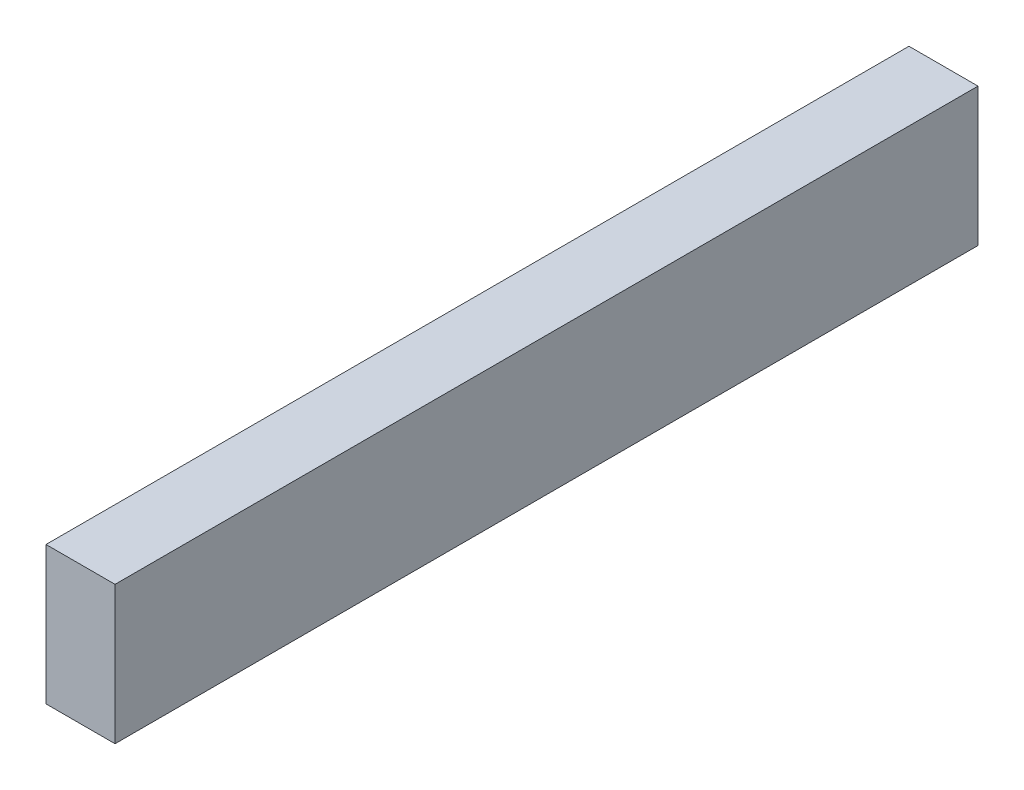
ISO-10303-21;
HEADER;
FILE_DESCRIPTION(('STEP AP214'),'2;1');
FILE_NAME('part.step','',(''),(''),'','','');
FILE_SCHEMA(('AUTOMOTIVE_DESIGN { 1 0 10303 214 1 1 1 1 }'));
ENDSEC;
DATA;
#1=APPLICATION_CONTEXT('core data for automotive mechanical design processes');
#2=APPLICATION_PROTOCOL_DEFINITION('international standard','automotive_design',2000,#1);
#3=PRODUCT_CONTEXT('',#1,'mechanical');
#4=PRODUCT('Part','Part','',(#3));
#5=PRODUCT_RELATED_PRODUCT_CATEGORY('part','',(#4));
#6=PRODUCT_DEFINITION_FORMATION('','',#4);
#7=PRODUCT_DEFINITION_CONTEXT('part definition',#1,'design');
#8=PRODUCT_DEFINITION('design','',#6,#7);
#9=PRODUCT_DEFINITION_SHAPE('','',#8);
#10=(LENGTH_UNIT() NAMED_UNIT(*) SI_UNIT(.MILLI.,.METRE.));
#11=(NAMED_UNIT(*) PLANE_ANGLE_UNIT() SI_UNIT($,.RADIAN.));
#12=(NAMED_UNIT(*) SI_UNIT($,.STERADIAN.) SOLID_ANGLE_UNIT());
#13=UNCERTAINTY_MEASURE_WITH_UNIT(LENGTH_MEASURE(1.E-05),#10,'distance_accuracy_value','');
#14=(GEOMETRIC_REPRESENTATION_CONTEXT(3) GLOBAL_UNCERTAINTY_ASSIGNED_CONTEXT((#13)) GLOBAL_UNIT_ASSIGNED_CONTEXT((#10,
#11,#12)) REPRESENTATION_CONTEXT('',''));
#15=CARTESIAN_POINT('',(0.,0.,0.));
#16=DIRECTION('',(0.,0.,1.));
#17=DIRECTION('',(1.,0.,0.));
#18=AXIS2_PLACEMENT_3D('',#15,#16,#17);
#19=CARTESIAN_POINT('',(152.,-32.3,692.64406037513));
#20=DIRECTION('',(0.,0.,-1.));
#21=DIRECTION('',(-1.,0.,0.));
#22=AXIS2_PLACEMENT_3D('',#19,#20,#21);
#23=PLANE('',#22);
#24=DIRECTION('',(0.,-1.,0.));
#25=VECTOR('',#24,1.);
#26=CARTESIAN_POINT('',(0.,-32.3,692.64406037513));
#27=LINE('',#26,#25);
#28=CARTESIAN_POINT('',(0.,271.7,692.64406037513));
#29=VERTEX_POINT('',#28);
#30=CARTESIAN_POINT('',(0.,-32.3,692.64406037513));
#31=VERTEX_POINT('',#30);
#32=EDGE_CURVE('E105',#29,#31,#27,.T.);
#33=ORIENTED_EDGE('',*,*,#32,.T.);
#34=DIRECTION('',(-1.,0.,0.));
#35=VECTOR('',#34,1.);
#36=CARTESIAN_POINT('',(152.,-32.3,692.64406037513));
#37=LINE('',#36,#35);
#38=CARTESIAN_POINT('',(152.,-32.3,692.64406037513));
#39=VERTEX_POINT('',#38);
#40=EDGE_CURVE('E12',#39,#31,#37,.T.);
#41=ORIENTED_EDGE('',*,*,#40,.F.);
#42=DIRECTION('',(0.,-1.,0.));
#43=VECTOR('',#42,1.);
#44=CARTESIAN_POINT('',(152.,-32.3,692.64406037513));
#45=LINE('',#44,#43);
#46=CARTESIAN_POINT('',(152.,271.7,692.64406037513));
#47=VERTEX_POINT('',#46);
#48=EDGE_CURVE('E93',#47,#39,#45,.T.);
#49=ORIENTED_EDGE('',*,*,#48,.F.);
#50=DIRECTION('',(-1.,0.,0.));
#51=VECTOR('',#50,1.);
#52=CARTESIAN_POINT('',(152.,271.7,692.64406037513));
#53=LINE('',#52,#51);
#54=EDGE_CURVE('E101',#47,#29,#53,.T.);
#55=ORIENTED_EDGE('',*,*,#54,.T.);
#56=EDGE_LOOP('',(#33,#41,#49,#55));
#57=FACE_BOUND('',#56,.T.);
#58=ADVANCED_FACE('F42',(#57),#23,.F.);
#59=CARTESIAN_POINT('',(152.,-32.3,692.64406037513));
#60=DIRECTION('',(0.,1.,0.));
#61=DIRECTION('',(0.,0.,1.));
#62=AXIS2_PLACEMENT_3D('',#59,#60,#61);
#63=PLANE('',#62);
#64=DIRECTION('',(0.,0.,-1.));
#65=VECTOR('',#64,1.);
#66=CARTESIAN_POINT('',(0.,-32.3,692.64406037513));
#67=LINE('',#66,#65);
#68=CARTESIAN_POINT('',(0.,-32.3,-1207.35593962487));
#69=VERTEX_POINT('',#68);
#70=EDGE_CURVE('E97',#31,#69,#67,.T.);
#71=ORIENTED_EDGE('',*,*,#70,.T.);
#72=DIRECTION('',(-1.,0.,0.));
#73=VECTOR('',#72,1.);
#74=CARTESIAN_POINT('',(152.,-32.3,-1207.35593962487));
#75=LINE('',#74,#73);
#76=CARTESIAN_POINT('',(152.,-32.3,-1207.35593962487));
#77=VERTEX_POINT('',#76);
#78=EDGE_CURVE('E50',#77,#69,#75,.T.);
#79=ORIENTED_EDGE('',*,*,#78,.F.);
#80=DIRECTION('',(0.,0.,-1.));
#81=VECTOR('',#80,1.);
#82=CARTESIAN_POINT('',(152.,-32.3,692.64406037513));
#83=LINE('',#82,#81);
#84=EDGE_CURVE('E88',#39,#77,#83,.T.);
#85=ORIENTED_EDGE('',*,*,#84,.F.);
#86=ORIENTED_EDGE('',*,*,#40,.T.);
#87=EDGE_LOOP('',(#71,#79,#85,#86));
#88=FACE_BOUND('',#87,.T.);
#89=ADVANCED_FACE('F96',(#88),#63,.F.);
#90=CARTESIAN_POINT('',(152.,-32.3,-1207.35593962487));
#91=DIRECTION('',(0.,0.,1.));
#92=DIRECTION('',(1.,0.,0.));
#93=AXIS2_PLACEMENT_3D('',#90,#91,#92);
#94=PLANE('',#93);
#95=DIRECTION('',(0.,1.,0.));
#96=VECTOR('',#95,1.);
#97=CARTESIAN_POINT('',(0.,-32.3,-1207.35593962487));
#98=LINE('',#97,#96);
#99=CARTESIAN_POINT('',(0.,271.7,-1207.35593962487));
#100=VERTEX_POINT('',#99);
#101=EDGE_CURVE('E75',#69,#100,#98,.T.);
#102=ORIENTED_EDGE('',*,*,#101,.T.);
#103=DIRECTION('',(-1.,0.,0.));
#104=VECTOR('',#103,1.);
#105=CARTESIAN_POINT('',(152.,271.7,-1207.35593962487));
#106=LINE('',#105,#104);
#107=CARTESIAN_POINT('',(152.,271.7,-1207.35593962487));
#108=VERTEX_POINT('',#107);
#109=EDGE_CURVE('E98',#108,#100,#106,.T.);
#110=ORIENTED_EDGE('',*,*,#109,.F.);
#111=DIRECTION('',(0.,1.,0.));
#112=VECTOR('',#111,1.);
#113=CARTESIAN_POINT('',(152.,-32.3,-1207.35593962487));
#114=LINE('',#113,#112);
#115=EDGE_CURVE('E91',#77,#108,#114,.T.);
#116=ORIENTED_EDGE('',*,*,#115,.F.);
#117=ORIENTED_EDGE('',*,*,#78,.T.);
#118=EDGE_LOOP('',(#102,#110,#116,#117));
#119=FACE_BOUND('',#118,.T.);
#120=ADVANCED_FACE('F99',(#119),#94,.F.);
#121=CARTESIAN_POINT('',(152.,271.7,692.64406037513));
#122=DIRECTION('',(0.,-1.,0.));
#123=DIRECTION('',(0.,0.,-1.));
#124=AXIS2_PLACEMENT_3D('',#121,#122,#123);
#125=PLANE('',#124);
#126=DIRECTION('',(0.,0.,1.));
#127=VECTOR('',#126,1.);
#128=CARTESIAN_POINT('',(0.,271.7,692.64406037513));
#129=LINE('',#128,#127);
#130=EDGE_CURVE('E81',#100,#29,#129,.T.);
#131=ORIENTED_EDGE('',*,*,#130,.T.);
#132=ORIENTED_EDGE('',*,*,#54,.F.);
#133=DIRECTION('',(0.,0.,1.));
#134=VECTOR('',#133,1.);
#135=CARTESIAN_POINT('',(152.,271.7,692.64406037513));
#136=LINE('',#135,#134);
#137=EDGE_CURVE('E58',#108,#47,#136,.T.);
#138=ORIENTED_EDGE('',*,*,#137,.F.);
#139=ORIENTED_EDGE('',*,*,#109,.T.);
#140=EDGE_LOOP('',(#131,#132,#138,#139));
#141=FACE_BOUND('',#140,.T.);
#142=ADVANCED_FACE('F112',(#141),#125,.F.);
#143=CARTESIAN_POINT('',(152.,0.,0.));
#144=DIRECTION('',(-1.,0.,0.));
#145=DIRECTION('',(0.,0.,1.));
#146=AXIS2_PLACEMENT_3D('',#143,#144,#145);
#147=PLANE('',#146);
#148=ORIENTED_EDGE('',*,*,#48,.T.);
#149=ORIENTED_EDGE('',*,*,#84,.T.);
#150=ORIENTED_EDGE('',*,*,#115,.T.);
#151=ORIENTED_EDGE('',*,*,#137,.T.);
#152=EDGE_LOOP('',(#148,#149,#150,#151));
#153=FACE_BOUND('',#152,.T.);
#154=ADVANCED_FACE('F89',(#153),#147,.F.);
#155=CARTESIAN_POINT('',(0.,0.,0.));
#156=DIRECTION('',(-1.,0.,0.));
#157=DIRECTION('',(0.,0.,1.));
#158=AXIS2_PLACEMENT_3D('',#155,#156,#157);
#159=PLANE('',#158);
#160=ORIENTED_EDGE('',*,*,#32,.F.);
#161=ORIENTED_EDGE('',*,*,#130,.F.);
#162=ORIENTED_EDGE('',*,*,#101,.F.);
#163=ORIENTED_EDGE('',*,*,#70,.F.);
#164=EDGE_LOOP('',(#160,#161,#162,#163));
#165=FACE_BOUND('',#164,.T.);
#166=ADVANCED_FACE('F115',(#165),#159,.T.);
#167=CLOSED_SHELL('',(#58,#89,#120,#142,#154,#166));
#168=MANIFOLD_SOLID_BREP('B2',#167);
#169=CARTESIAN_POINT('',(69.,0.,0.));
#170=DIRECTION('',(0.,1.,0.));
#171=DIRECTION('',(0.,0.,1.));
#172=AXIS2_PLACEMENT_3D('',#169,#170,#171);
#173=PLANE('',#172);
#174=DIRECTION('',(-1.,0.,0.));
#175=VECTOR('',#174,1.);
#176=CARTESIAN_POINT('',(-48.6,0.,-92.6559396248703));
#177=LINE('',#176,#175);
#178=CARTESIAN_POINT('',(-48.6,0.,-92.6559396248703));
#179=VERTEX_POINT('',#178);
#180=CARTESIAN_POINT('',(-69.,0.,-92.6559396248703));
#181=VERTEX_POINT('',#180);
#182=EDGE_CURVE('E354',#179,#181,#177,.T.);
#183=ORIENTED_EDGE('',*,*,#182,.T.);
#184=DIRECTION('',(0.,0.,-1.));
#185=VECTOR('',#184,1.);
#186=CARTESIAN_POINT('',(-69.,0.,0.));
#187=LINE('',#186,#185);
#188=CARTESIAN_POINT('',(-69.,0.,-165.1));
#189=VERTEX_POINT('',#188);
#190=EDGE_CURVE('E338',#181,#189,#187,.T.);
#191=ORIENTED_EDGE('',*,*,#190,.T.);
#192=DIRECTION('',(-1.,0.,0.));
#193=VECTOR('',#192,1.);
#194=CARTESIAN_POINT('',(69.,0.,-165.1));
#195=LINE('',#194,#193);
#196=CARTESIAN_POINT('',(69.,0.,-165.1));
#197=VERTEX_POINT('',#196);
#198=EDGE_CURVE('E489',#197,#189,#195,.T.);
#199=ORIENTED_EDGE('',*,*,#198,.F.);
#200=DIRECTION('',(0.,0.,-1.));
#201=VECTOR('',#200,1.);
#202=CARTESIAN_POINT('',(69.,0.,262.79362659682));
#203=LINE('',#202,#201);
#204=CARTESIAN_POINT('',(69.,0.,-92.6559396248703));
#205=VERTEX_POINT('',#204);
#206=EDGE_CURVE('E438',#205,#197,#203,.T.);
#207=ORIENTED_EDGE('',*,*,#206,.F.);
#208=DIRECTION('',(1.,0.,0.));
#209=VECTOR('',#208,1.);
#210=CARTESIAN_POINT('',(48.6,0.,-92.6559396248703));
#211=LINE('',#210,#209);
#212=CARTESIAN_POINT('',(48.6,0.,-92.6559396248703));
#213=VERTEX_POINT('',#212);
#214=EDGE_CURVE('E391',#213,#205,#211,.T.);
#215=ORIENTED_EDGE('',*,*,#214,.F.);
#216=DIRECTION('',(0.,0.,1.));
#217=VECTOR('',#216,1.);
#218=CARTESIAN_POINT('',(48.6,0.,-28.0559396248703));
#219=LINE('',#218,#217);
#220=CARTESIAN_POINT('',(48.6,0.,-28.0559396248703));
#221=VERTEX_POINT('',#220);
#222=EDGE_CURVE('E388',#213,#221,#219,.T.);
#223=ORIENTED_EDGE('',*,*,#222,.T.);
#224=DIRECTION('',(1.,0.,0.));
#225=VECTOR('',#224,1.);
#226=CARTESIAN_POINT('',(48.6,0.,-28.0559396248703));
#227=LINE('',#226,#225);
#228=CARTESIAN_POINT('',(69.,0.,-28.0559396248703));
#229=VERTEX_POINT('',#228);
#230=EDGE_CURVE('E393',#221,#229,#227,.T.);
#231=ORIENTED_EDGE('',*,*,#230,.T.);
#232=CARTESIAN_POINT('',(69.,0.,160.34406037513));
#233=VERTEX_POINT('',#232);
#234=EDGE_CURVE('E444',#233,#229,#203,.T.);
#235=ORIENTED_EDGE('',*,*,#234,.F.);
#236=DIRECTION('',(1.,0.,0.));
#237=VECTOR('',#236,1.);
#238=CARTESIAN_POINT('',(48.6,0.,160.34406037513));
#239=LINE('',#238,#237);
#240=CARTESIAN_POINT('',(48.6,0.,160.34406037513));
#241=VERTEX_POINT('',#240);
#242=EDGE_CURVE('E404',#241,#233,#239,.T.);
#243=ORIENTED_EDGE('',*,*,#242,.F.);
#244=DIRECTION('',(0.,0.,1.));
#245=VECTOR('',#244,1.);
#246=CARTESIAN_POINT('',(48.6,0.,224.94406037513));
#247=LINE('',#246,#245);
#248=CARTESIAN_POINT('',(48.6,0.,224.94406037513));
#249=VERTEX_POINT('',#248);
#250=EDGE_CURVE('E401',#241,#249,#247,.T.);
#251=ORIENTED_EDGE('',*,*,#250,.T.);
#252=DIRECTION('',(1.,0.,0.));
#253=VECTOR('',#252,1.);
#254=CARTESIAN_POINT('',(48.6,0.,224.94406037513));
#255=LINE('',#254,#253);
#256=CARTESIAN_POINT('',(69.,0.,224.94406037513));
#257=VERTEX_POINT('',#256);
#258=EDGE_CURVE('E406',#249,#257,#255,.T.);
#259=ORIENTED_EDGE('',*,*,#258,.T.);
#260=CARTESIAN_POINT('',(69.,0.,262.79362659682));
#261=VERTEX_POINT('',#260);
#262=EDGE_CURVE('E440',#261,#257,#203,.T.);
#263=ORIENTED_EDGE('',*,*,#262,.F.);
#264=DIRECTION('',(-1.,0.,0.));
#265=VECTOR('',#264,1.);
#266=CARTESIAN_POINT('',(69.,0.,262.79362659682));
#267=LINE('',#266,#265);
#268=CARTESIAN_POINT('',(-69.,0.,262.79362659682));
#269=VERTEX_POINT('',#268);
#270=EDGE_CURVE('E491',#261,#269,#267,.T.);
#271=ORIENTED_EDGE('',*,*,#270,.T.);
#272=CARTESIAN_POINT('',(-69.,0.,224.94406037513));
#273=VERTEX_POINT('',#272);
#274=EDGE_CURVE('E352',#269,#273,#187,.T.);
#275=ORIENTED_EDGE('',*,*,#274,.T.);
#276=DIRECTION('',(-1.,0.,0.));
#277=VECTOR('',#276,1.);
#278=CARTESIAN_POINT('',(-48.6,0.,224.94406037513));
#279=LINE('',#278,#277);
#280=CARTESIAN_POINT('',(-48.6,0.,224.94406037513));
#281=VERTEX_POINT('',#280);
#282=EDGE_CURVE('E377',#281,#273,#279,.T.);
#283=ORIENTED_EDGE('',*,*,#282,.F.);
#284=DIRECTION('',(0.,0.,1.));
#285=VECTOR('',#284,1.);
#286=CARTESIAN_POINT('',(-48.6,0.,224.94406037513));
#287=LINE('',#286,#285);
#288=CARTESIAN_POINT('',(-48.6,0.,160.34406037513));
#289=VERTEX_POINT('',#288);
#290=EDGE_CURVE('E374',#289,#281,#287,.T.);
#291=ORIENTED_EDGE('',*,*,#290,.F.);
#292=DIRECTION('',(-1.,0.,0.));
#293=VECTOR('',#292,1.);
#294=CARTESIAN_POINT('',(-48.6,0.,160.34406037513));
#295=LINE('',#294,#293);
#296=CARTESIAN_POINT('',(-69.,0.,160.34406037513));
#297=VERTEX_POINT('',#296);
#298=EDGE_CURVE('E380',#289,#297,#295,.T.);
#299=ORIENTED_EDGE('',*,*,#298,.T.);
#300=CARTESIAN_POINT('',(-69.,0.,-28.0559396248702));
#301=VERTEX_POINT('',#300);
#302=EDGE_CURVE('E349',#297,#301,#187,.T.);
#303=ORIENTED_EDGE('',*,*,#302,.T.);
#304=DIRECTION('',(-1.,0.,0.));
#305=VECTOR('',#304,1.);
#306=CARTESIAN_POINT('',(-48.6,0.,-28.0559396248703));
#307=LINE('',#306,#305);
#308=CARTESIAN_POINT('',(-48.6,0.,-28.0559396248703));
#309=VERTEX_POINT('',#308);
#310=EDGE_CURVE('E361',#309,#301,#307,.T.);
#311=ORIENTED_EDGE('',*,*,#310,.F.);
#312=DIRECTION('',(0.,0.,1.));
#313=VECTOR('',#312,1.);
#314=CARTESIAN_POINT('',(-48.6,0.,-28.0559396248703));
#315=LINE('',#314,#313);
#316=EDGE_CURVE('E356',#179,#309,#315,.T.);
#317=ORIENTED_EDGE('',*,*,#316,.F.);
#318=EDGE_LOOP('',(#183,#191,#199,#207,#215,#223,#231,#235,#243,#251,#259,#263,#271,#275,#283,
#291,#299,#303,#311,#317));
#319=FACE_BOUND('',#318,.T.);
#320=ADVANCED_FACE('F165',(#319),#173,.F.);
#321=CARTESIAN_POINT('',(69.,81.9,-150.1));
#322=DIRECTION('',(0.,0.,-1.));
#323=DIRECTION('',(-1.,0.,0.));
#324=AXIS2_PLACEMENT_3D('',#321,#322,#323);
#325=PLANE('',#324);
#326=DIRECTION('',(-1.,0.,0.));
#327=VECTOR('',#326,1.);
#328=CARTESIAN_POINT('',(69.,81.9,-150.1));
#329=LINE('',#328,#327);
#330=CARTESIAN_POINT('',(54.,81.9,-150.1));
#331=VERTEX_POINT('',#330);
#332=CARTESIAN_POINT('',(-54.,81.9,-150.1));
#333=VERTEX_POINT('',#332);
#334=EDGE_CURVE('E484',#331,#333,#329,.T.);
#335=ORIENTED_EDGE('',*,*,#334,.T.);
#336=DIRECTION('',(0.,-1.,0.));
#337=VECTOR('',#336,1.);
#338=CARTESIAN_POINT('',(-54.,232.747638364013,-150.1));
#339=LINE('',#338,#337);
#340=CARTESIAN_POINT('',(-54.,20.,-150.1));
#341=VERTEX_POINT('',#340);
#342=EDGE_CURVE('E421',#333,#341,#339,.T.);
#343=ORIENTED_EDGE('',*,*,#342,.T.);
#344=DIRECTION('',(-1.,0.,0.));
#345=VECTOR('',#344,1.);
#346=CARTESIAN_POINT('',(69.,20.,-150.1));
#347=LINE('',#346,#345);
#348=CARTESIAN_POINT('',(54.,20.,-150.1));
#349=VERTEX_POINT('',#348);
#350=EDGE_CURVE('E481',#349,#341,#347,.T.);
#351=ORIENTED_EDGE('',*,*,#350,.F.);
#352=DIRECTION('',(0.,-1.,0.));
#353=VECTOR('',#352,1.);
#354=CARTESIAN_POINT('',(54.,232.747638364013,-150.1));
#355=LINE('',#354,#353);
#356=EDGE_CURVE('E432',#331,#349,#355,.T.);
#357=ORIENTED_EDGE('',*,*,#356,.F.);
#358=EDGE_LOOP('',(#335,#343,#351,#357));
#359=FACE_BOUND('',#358,.T.);
#360=ADVANCED_FACE('F606',(#359),#325,.F.);
#361=CARTESIAN_POINT('',(69.,20.,-150.1));
#362=DIRECTION('',(0.,-1.,0.));
#363=DIRECTION('',(0.,0.,-1.));
#364=AXIS2_PLACEMENT_3D('',#361,#362,#363);
#365=PLANE('',#364);
#366=ORIENTED_EDGE('',*,*,#350,.T.);
#367=DIRECTION('',(0.,0.,1.));
#368=VECTOR('',#367,1.);
#369=CARTESIAN_POINT('',(-54.,20.,0.));
#370=LINE('',#369,#368);
#371=CARTESIAN_POINT('',(-54.,20.,0.));
#372=VERTEX_POINT('',#371);
#373=EDGE_CURVE('E409',#341,#372,#370,.T.);
#374=ORIENTED_EDGE('',*,*,#373,.T.);
#375=DIRECTION('',(-1.,0.,0.));
#376=VECTOR('',#375,1.);
#377=CARTESIAN_POINT('',(69.,20.,0.));
#378=LINE('',#377,#376);
#379=CARTESIAN_POINT('',(54.,20.,0.));
#380=VERTEX_POINT('',#379);
#381=EDGE_CURVE('E461',#380,#372,#378,.T.);
#382=ORIENTED_EDGE('',*,*,#381,.F.);
#383=DIRECTION('',(0.,0.,1.));
#384=VECTOR('',#383,1.);
#385=CARTESIAN_POINT('',(54.,20.,0.));
#386=LINE('',#385,#384);
#387=EDGE_CURVE('E419',#349,#380,#386,.T.);
#388=ORIENTED_EDGE('',*,*,#387,.F.);
#389=EDGE_LOOP('',(#366,#374,#382,#388));
#390=FACE_BOUND('',#389,.T.);
#391=ADVANCED_FACE('F611',(#390),#365,.F.);
#392=CARTESIAN_POINT('',(69.,20.,0.));
#393=DIRECTION('',(0.,0.,1.));
#394=DIRECTION('',(1.,0.,0.));
#395=AXIS2_PLACEMENT_3D('',#392,#393,#394);
#396=PLANE('',#395);
#397=DIRECTION('',(0.,1.,0.));
#398=VECTOR('',#397,1.);
#399=CARTESIAN_POINT('',(-69.,20.,0.));
#400=LINE('',#399,#398);
#401=CARTESIAN_POINT('',(-69.,81.8999999999999,0.));
#402=VERTEX_POINT('',#401);
#403=CARTESIAN_POINT('',(-69.,123.7,0.));
#404=VERTEX_POINT('',#403);
#405=EDGE_CURVE('E466',#402,#404,#400,.T.);
#406=ORIENTED_EDGE('',*,*,#405,.T.);
#407=DIRECTION('',(-1.,0.,0.));
#408=VECTOR('',#407,1.);
#409=CARTESIAN_POINT('',(69.,123.7,0.));
#410=LINE('',#409,#408);
#411=CARTESIAN_POINT('',(69.,123.7,0.));
#412=VERTEX_POINT('',#411);
#413=EDGE_CURVE('E513',#404,#412,#410,.F.);
#414=ORIENTED_EDGE('',*,*,#413,.T.);
#415=DIRECTION('',(0.,1.,0.));
#416=VECTOR('',#415,1.);
#417=CARTESIAN_POINT('',(69.,20.,0.));
#418=LINE('',#417,#416);
#419=CARTESIAN_POINT('',(69.,81.8999999999998,0.));
#420=VERTEX_POINT('',#419);
#421=EDGE_CURVE('E448',#420,#412,#418,.T.);
#422=ORIENTED_EDGE('',*,*,#421,.F.);
#423=DIRECTION('',(-1.,0.,0.));
#424=VECTOR('',#423,1.);
#425=CARTESIAN_POINT('',(69.,81.8999999999998,0.));
#426=LINE('',#425,#424);
#427=CARTESIAN_POINT('',(54.,81.8999999999999,0.));
#428=VERTEX_POINT('',#427);
#429=EDGE_CURVE('E427',#420,#428,#426,.T.);
#430=ORIENTED_EDGE('',*,*,#429,.T.);
#431=DIRECTION('',(0.,-1.,0.));
#432=VECTOR('',#431,1.);
#433=CARTESIAN_POINT('',(54.,232.747638364013,0.));
#434=LINE('',#433,#432);
#435=EDGE_CURVE('E429',#428,#380,#434,.T.);
#436=ORIENTED_EDGE('',*,*,#435,.T.);
#437=ORIENTED_EDGE('',*,*,#381,.T.);
#438=DIRECTION('',(0.,-1.,0.));
#439=VECTOR('',#438,1.);
#440=CARTESIAN_POINT('',(-54.,232.747638364013,0.));
#441=LINE('',#440,#439);
#442=CARTESIAN_POINT('',(-54.,81.8999999999998,0.));
#443=VERTEX_POINT('',#442);
#444=EDGE_CURVE('E416',#443,#372,#441,.T.);
#445=ORIENTED_EDGE('',*,*,#444,.F.);
#446=DIRECTION('',(1.,0.,0.));
#447=VECTOR('',#446,1.);
#448=CARTESIAN_POINT('',(-69.,81.8999999999998,0.));
#449=LINE('',#448,#447);
#450=EDGE_CURVE('E415',#402,#443,#449,.T.);
#451=ORIENTED_EDGE('',*,*,#450,.F.);
#452=EDGE_LOOP('',(#406,#414,#422,#430,#436,#437,#445,#451));
#453=FACE_BOUND('',#452,.T.);
#454=ADVANCED_FACE('F619',(#453),#396,.F.);
#455=CARTESIAN_POINT('',(69.,15.7395723137565,255.14406037513));
#456=DIRECTION('',(-1.,0.,0.));
#457=DIRECTION('',(0.,0.,1.));
#458=AXIS2_PLACEMENT_3D('',#455,#456,#457);
#459=CYLINDRICAL_SURFACE('',#458,17.5);
#460=CARTESIAN_POINT('',(69.,15.7395723137565,255.14406037513));
#461=DIRECTION('',(1.,0.,0.));
#462=DIRECTION('',(0.,0.,-1.));
#463=AXIS2_PLACEMENT_3D('',#460,#461,#462);
#464=CIRCLE('',#463,17.5);
#465=CARTESIAN_POINT('',(69.,29.1597981364929,266.375602516206));
#466=VERTEX_POINT('',#465);
#467=EDGE_CURVE('E436',#466,#261,#464,.T.);
#468=ORIENTED_EDGE('',*,*,#467,.F.);
#469=DIRECTION('',(-1.,0.,0.));
#470=VECTOR('',#469,1.);
#471=CARTESIAN_POINT('',(69.,29.1597981364929,266.375602516206));
#472=LINE('',#471,#470);
#473=CARTESIAN_POINT('',(-69.,29.1597981364929,266.375602516206));
#474=VERTEX_POINT('',#473);
#475=EDGE_CURVE('E494',#466,#474,#472,.T.);
#476=ORIENTED_EDGE('',*,*,#475,.T.);
#477=CARTESIAN_POINT('',(-69.,15.7395723137565,255.14406037513));
#478=DIRECTION('',(1.,0.,0.));
#479=DIRECTION('',(0.,0.,-1.));
#480=AXIS2_PLACEMENT_3D('',#477,#478,#479);
#481=CIRCLE('',#480,17.5);
#482=EDGE_CURVE('E350',#474,#269,#481,.T.);
#483=ORIENTED_EDGE('',*,*,#482,.T.);
#484=ORIENTED_EDGE('',*,*,#270,.F.);
#485=EDGE_LOOP('',(#468,#476,#483,#484));
#486=FACE_BOUND('',#485,.T.);
#487=ADVANCED_FACE('F561',(#486),#459,.T.);
#488=CARTESIAN_POINT('',(69.,0.,-165.1));
#489=DIRECTION('',(0.,0.,1.));
#490=DIRECTION('',(1.,0.,0.));
#491=AXIS2_PLACEMENT_3D('',#488,#489,#490);
#492=PLANE('',#491);
#493=DIRECTION('',(0.,1.,0.));
#494=VECTOR('',#493,1.);
#495=CARTESIAN_POINT('',(-69.,0.,-165.1));
#496=LINE('',#495,#494);
#497=CARTESIAN_POINT('',(-69.,81.9,-165.1));
#498=VERTEX_POINT('',#497);
#499=EDGE_CURVE('E345',#189,#498,#496,.T.);
#500=ORIENTED_EDGE('',*,*,#499,.T.);
#501=DIRECTION('',(-1.,0.,0.));
#502=VECTOR('',#501,1.);
#503=CARTESIAN_POINT('',(69.,81.9,-165.1));
#504=LINE('',#503,#502);
#505=CARTESIAN_POINT('',(69.,81.9,-165.1));
#506=VERTEX_POINT('',#505);
#507=EDGE_CURVE('E486',#506,#498,#504,.T.);
#508=ORIENTED_EDGE('',*,*,#507,.F.);
#509=DIRECTION('',(0.,1.,0.));
#510=VECTOR('',#509,1.);
#511=CARTESIAN_POINT('',(69.,0.,-165.1));
#512=LINE('',#511,#510);
#513=EDGE_CURVE('E443',#197,#506,#512,.T.);
#514=ORIENTED_EDGE('',*,*,#513,.F.);
#515=ORIENTED_EDGE('',*,*,#198,.T.);
#516=EDGE_LOOP('',(#500,#508,#514,#515));
#517=FACE_BOUND('',#516,.T.);
#518=ADVANCED_FACE('F578',(#517),#492,.F.);
#519=CARTESIAN_POINT('',(69.,81.9,-165.1));
#520=DIRECTION('',(0.,-1.,0.));
#521=DIRECTION('',(0.,0.,-1.));
#522=AXIS2_PLACEMENT_3D('',#519,#520,#521);
#523=PLANE('',#522);
#524=DIRECTION('',(0.,0.,1.));
#525=VECTOR('',#524,1.);
#526=CARTESIAN_POINT('',(-69.,81.9,-165.1));
#527=LINE('',#526,#525);
#528=EDGE_CURVE('E464',#498,#402,#527,.T.);
#529=ORIENTED_EDGE('',*,*,#528,.T.);
#530=ORIENTED_EDGE('',*,*,#450,.T.);
#531=DIRECTION('',(0.,0.,-1.));
#532=VECTOR('',#531,1.);
#533=CARTESIAN_POINT('',(-54.,81.8999999999998,-1.1346331053111E-13));
#534=LINE('',#533,#532);
#535=EDGE_CURVE('E412',#443,#333,#534,.T.);
#536=ORIENTED_EDGE('',*,*,#535,.T.);
#537=ORIENTED_EDGE('',*,*,#334,.F.);
#538=DIRECTION('',(0.,0.,-1.));
#539=VECTOR('',#538,1.);
#540=CARTESIAN_POINT('',(54.,81.8999999999998,-1.1346331053111E-13));
#541=LINE('',#540,#539);
#542=EDGE_CURVE('E425',#428,#331,#541,.T.);
#543=ORIENTED_EDGE('',*,*,#542,.F.);
#544=ORIENTED_EDGE('',*,*,#429,.F.);
#545=DIRECTION('',(0.,0.,1.));
#546=VECTOR('',#545,1.);
#547=CARTESIAN_POINT('',(69.,81.9,-165.1));
#548=LINE('',#547,#546);
#549=EDGE_CURVE('E446',#506,#420,#548,.T.);
#550=ORIENTED_EDGE('',*,*,#549,.F.);
#551=ORIENTED_EDGE('',*,*,#507,.T.);
#552=EDGE_LOOP('',(#529,#530,#536,#537,#543,#544,#550,#551));
#553=FACE_BOUND('',#552,.T.);
#554=ADVANCED_FACE('F582',(#553),#523,.F.);
#555=CARTESIAN_POINT('',(69.,133.7,0.));
#556=DIRECTION('',(0.,-1.,0.));
#557=DIRECTION('',(0.,0.,-1.));
#558=AXIS2_PLACEMENT_3D('',#555,#556,#557);
#559=PLANE('',#558);
#560=DIRECTION('',(0.,0.,1.));
#561=VECTOR('',#560,1.);
#562=CARTESIAN_POINT('',(69.,133.7,0.));
#563=LINE('',#562,#561);
#564=CARTESIAN_POINT('',(69.,133.7,10.));
#565=VERTEX_POINT('',#564);
#566=CARTESIAN_POINT('',(69.,133.7,111.84701211121));
#567=VERTEX_POINT('',#566);
#568=EDGE_CURVE('E451',#565,#567,#563,.T.);
#569=ORIENTED_EDGE('',*,*,#568,.F.);
#570=DIRECTION('',(-1.,0.,0.));
#571=VECTOR('',#570,1.);
#572=CARTESIAN_POINT('',(69.,133.7,10.));
#573=LINE('',#572,#571);
#574=CARTESIAN_POINT('',(-69.,133.7,10.));
#575=VERTEX_POINT('',#574);
#576=EDGE_CURVE('E504',#565,#575,#573,.T.);
#577=ORIENTED_EDGE('',*,*,#576,.T.);
#578=DIRECTION('',(0.,0.,1.));
#579=VECTOR('',#578,1.);
#580=CARTESIAN_POINT('',(-69.,133.7,0.));
#581=LINE('',#580,#579);
#582=CARTESIAN_POINT('',(-69.,133.7,111.84701211121));
#583=VERTEX_POINT('',#582);
#584=EDGE_CURVE('E469',#575,#583,#581,.T.);
#585=ORIENTED_EDGE('',*,*,#584,.T.);
#586=DIRECTION('',(-1.,0.,0.));
#587=VECTOR('',#586,1.);
#588=CARTESIAN_POINT('',(69.,133.7,111.84701211121));
#589=LINE('',#588,#587);
#590=EDGE_CURVE('E502',#583,#567,#589,.F.);
#591=ORIENTED_EDGE('',*,*,#590,.T.);
#592=EDGE_LOOP('',(#569,#577,#585,#591));
#593=FACE_BOUND('',#592,.T.);
#594=ADVANCED_FACE('F592',(#593),#559,.F.);
#595=CARTESIAN_POINT('',(69.,133.7,115.));
#596=DIRECTION('',(0.,-0.819152044288995,-0.573576436351042));
#597=DIRECTION('',(0.,0.573576436351042,-0.819152044288995));
#598=AXIS2_PLACEMENT_3D('',#595,#596,#597);
#599=PLANE('',#598);
#600=DIRECTION('',(0.,-0.573576436351042,0.819152044288994));
#601=VECTOR('',#600,1.);
#602=CARTESIAN_POINT('',(69.,133.7,115.));
#603=LINE('',#602,#601);
#604=CARTESIAN_POINT('',(69.,131.89152044289,117.582776474721));
#605=VERTEX_POINT('',#604);
#606=CARTESIAN_POINT('',(69.,95.7296916570861,169.227220175317));
#607=VERTEX_POINT('',#606);
#608=EDGE_CURVE('E454',#605,#607,#603,.T.);
#609=ORIENTED_EDGE('',*,*,#608,.F.);
#610=DIRECTION('',(-1.,0.,0.));
#611=VECTOR('',#610,1.);
#612=CARTESIAN_POINT('',(69.,131.89152044289,117.582776474721));
#613=LINE('',#612,#611);
#614=CARTESIAN_POINT('',(-69.,131.89152044289,117.582776474721));
#615=VERTEX_POINT('',#614);
#616=EDGE_CURVE('E523',#605,#615,#613,.T.);
#617=ORIENTED_EDGE('',*,*,#616,.T.);
#618=DIRECTION('',(0.,-0.573576436351042,0.819152044288994));
#619=VECTOR('',#618,1.);
#620=CARTESIAN_POINT('',(-69.,133.7,115.));
#621=LINE('',#620,#619);
#622=CARTESIAN_POINT('',(-69.,95.7296916570861,169.227220175317));
#623=VERTEX_POINT('',#622);
#624=EDGE_CURVE('E472',#615,#623,#621,.T.);
#625=ORIENTED_EDGE('',*,*,#624,.T.);
#626=DIRECTION('',(-1.,0.,0.));
#627=VECTOR('',#626,1.);
#628=CARTESIAN_POINT('',(69.,95.7296916570861,169.227220175317));
#629=LINE('',#628,#627);
#630=EDGE_CURVE('E521',#623,#607,#629,.F.);
#631=ORIENTED_EDGE('',*,*,#630,.T.);
#632=EDGE_LOOP('',(#609,#617,#625,#631));
#633=FACE_BOUND('',#632,.T.);
#634=ADVANCED_FACE('F540',(#633),#599,.F.);
#635=CARTESIAN_POINT('',(69.,94.3526564663185,171.193830238225));
#636=DIRECTION('',(0.,-0.990268068741571,-0.139173100960059));
#637=DIRECTION('',(0.,0.139173100960059,-0.990268068741571));
#638=AXIS2_PLACEMENT_3D('',#635,#636,#637);
#639=PLANE('',#638);
#640=DIRECTION('',(0.,-0.139173100960059,0.990268068741571));
#641=VECTOR('',#640,1.);
#642=CARTESIAN_POINT('',(69.,94.3526564663185,171.193830238225));
#643=LINE('',#642,#641);
#644=CARTESIAN_POINT('',(69.,94.0185314125603,173.571253529226));
#645=VERTEX_POINT('',#644);
#646=CARTESIAN_POINT('',(69.,82.6889579367665,254.185357606421));
#647=VERTEX_POINT('',#646);
#648=EDGE_CURVE('E456',#645,#647,#643,.T.);
#649=ORIENTED_EDGE('',*,*,#648,.F.);
#650=DIRECTION('',(-1.,0.,0.));
#651=VECTOR('',#650,1.);
#652=CARTESIAN_POINT('',(-69.,94.0185314125603,173.571253529226));
#653=LINE('',#652,#651);
#654=CARTESIAN_POINT('',(-69.,94.0185314125603,173.571253529226));
#655=VERTEX_POINT('',#654);
#656=EDGE_CURVE('E527',#645,#655,#653,.T.);
#657=ORIENTED_EDGE('',*,*,#656,.T.);
#658=DIRECTION('',(0.,-0.139173100960059,0.990268068741571));
#659=VECTOR('',#658,1.);
#660=CARTESIAN_POINT('',(-69.,94.3526564663185,171.193830238225));
#661=LINE('',#660,#659);
#662=CARTESIAN_POINT('',(-69.,82.6889579367665,254.185357606421));
#663=VERTEX_POINT('',#662);
#664=EDGE_CURVE('E475',#655,#663,#661,.T.);
#665=ORIENTED_EDGE('',*,*,#664,.T.);
#666=DIRECTION('',(-1.,0.,0.));
#667=VECTOR('',#666,1.);
#668=CARTESIAN_POINT('',(69.,82.6889579367665,254.185357606421));
#669=LINE('',#668,#667);
#670=EDGE_CURVE('E180',#663,#647,#669,.F.);
#671=ORIENTED_EDGE('',*,*,#670,.T.);
#672=EDGE_LOOP('',(#649,#657,#665,#671));
#673=FACE_BOUND('',#672,.T.);
#674=ADVANCED_FACE('F543',(#673),#639,.F.);
#675=CARTESIAN_POINT('',(69.,81.4791446275131,262.79362659682));
#676=DIRECTION('',(0.,0.,-1.));
#677=DIRECTION('',(0.,1.,0.));
#678=AXIS2_PLACEMENT_3D('',#675,#676,#677);
#679=PLANE('',#678);
#680=DIRECTION('',(0.,-1.,0.));
#681=VECTOR('',#680,1.);
#682=CARTESIAN_POINT('',(-69.,81.4791446275131,262.79362659682));
#683=LINE('',#682,#681);
#684=CARTESIAN_POINT('',(-69.,72.7862772493507,262.79362659682));
#685=VERTEX_POINT('',#684);
#686=CARTESIAN_POINT('',(-69.,36.8284986066279,262.79362659682));
#687=VERTEX_POINT('',#686);
#688=EDGE_CURVE('E439',#685,#687,#683,.T.);
#689=ORIENTED_EDGE('',*,*,#688,.T.);
#690=DIRECTION('',(1.,0.,0.));
#691=VECTOR('',#690,1.);
#692=CARTESIAN_POINT('',(69.,36.8284986066279,262.79362659682));
#693=LINE('',#692,#691);
#694=CARTESIAN_POINT('',(69.,36.8284986066279,262.79362659682));
#695=VERTEX_POINT('',#694);
#696=EDGE_CURVE('E500',#687,#695,#693,.T.);
#697=ORIENTED_EDGE('',*,*,#696,.T.);
#698=DIRECTION('',(0.,-1.,0.));
#699=VECTOR('',#698,1.);
#700=CARTESIAN_POINT('',(69.,81.4791446275131,262.79362659682));
#701=LINE('',#700,#699);
#702=CARTESIAN_POINT('',(69.,72.7862772493507,262.79362659682));
#703=VERTEX_POINT('',#702);
#704=EDGE_CURVE('E458',#703,#695,#701,.T.);
#705=ORIENTED_EDGE('',*,*,#704,.F.);
#706=DIRECTION('',(-1.,0.,0.));
#707=VECTOR('',#706,1.);
#708=CARTESIAN_POINT('',(69.,72.7862772493507,262.79362659682));
#709=LINE('',#708,#707);
#710=EDGE_CURVE('E497',#703,#685,#709,.T.);
#711=ORIENTED_EDGE('',*,*,#710,.T.);
#712=EDGE_LOOP('',(#689,#697,#705,#711));
#713=FACE_BOUND('',#712,.T.);
#714=ADVANCED_FACE('F551',(#713),#679,.F.);
#715=CARTESIAN_POINT('',(69.,15.7395723137565,255.14406037513));
#716=DIRECTION('',(1.,0.,0.));
#717=DIRECTION('',(0.,0.,-1.));
#718=AXIS2_PLACEMENT_3D('',#715,#716,#717);
#719=PLANE('',#718);
#720=ORIENTED_EDGE('',*,*,#421,.T.);
#721=CARTESIAN_POINT('',(69.,123.7,10.));
#722=DIRECTION('',(1.,0.,0.));
#723=DIRECTION('',(0.,0.,-1.));
#724=AXIS2_PLACEMENT_3D('',#721,#722,#723);
#725=CIRCLE('',#724,10.);
#726=EDGE_CURVE('E519',#412,#565,#725,.T.);
#727=ORIENTED_EDGE('',*,*,#726,.T.);
#728=ORIENTED_EDGE('',*,*,#568,.T.);
#729=CARTESIAN_POINT('',(69.,123.7,111.84701211121));
#730=DIRECTION('',(1.,0.,0.));
#731=DIRECTION('',(0.,0.,-1.));
#732=AXIS2_PLACEMENT_3D('',#729,#730,#731);
#733=CIRCLE('',#732,10.);
#734=EDGE_CURVE('E517',#567,#605,#733,.T.);
#735=ORIENTED_EDGE('',*,*,#734,.T.);
#736=ORIENTED_EDGE('',*,*,#608,.T.);
#737=CARTESIAN_POINT('',(69.,103.921212099976,174.962984538827));
#738=DIRECTION('',(1.,0.,0.));
#739=DIRECTION('',(0.,0.,-1.));
#740=AXIS2_PLACEMENT_3D('',#737,#738,#739);
#741=CIRCLE('',#740,10.);
#742=EDGE_CURVE('E40',#607,#645,#741,.F.);
#743=ORIENTED_EDGE('',*,*,#742,.T.);
#744=ORIENTED_EDGE('',*,*,#648,.T.);
#745=CARTESIAN_POINT('',(69.,72.7862772493507,252.79362659682));
#746=DIRECTION('',(1.,0.,0.));
#747=DIRECTION('',(0.,0.,-1.));
#748=AXIS2_PLACEMENT_3D('',#745,#746,#747);
#749=CIRCLE('',#748,10.);
#750=EDGE_CURVE('E515',#647,#703,#749,.T.);
#751=ORIENTED_EDGE('',*,*,#750,.T.);
#752=ORIENTED_EDGE('',*,*,#704,.T.);
#753=CARTESIAN_POINT('',(69.,36.8284986066279,272.79362659682));
#754=DIRECTION('',(1.,0.,0.));
#755=DIRECTION('',(0.,0.,-1.));
#756=AXIS2_PLACEMENT_3D('',#753,#754,#755);
#757=CIRCLE('',#756,10.);
#758=EDGE_CURVE('E532',#695,#466,#757,.F.);
#759=ORIENTED_EDGE('',*,*,#758,.T.);
#760=ORIENTED_EDGE('',*,*,#467,.T.);
#761=ORIENTED_EDGE('',*,*,#262,.T.);
#762=CARTESIAN_POINT('',(69.,0.,192.64406037513));
#763=DIRECTION('',(1.,0.,0.));
#764=DIRECTION('',(0.,0.,-1.));
#765=AXIS2_PLACEMENT_3D('',#762,#763,#764);
#766=CIRCLE('',#765,32.3);
#767=EDGE_CURVE('E396',#257,#233,#766,.T.);
#768=ORIENTED_EDGE('',*,*,#767,.T.);
#769=ORIENTED_EDGE('',*,*,#234,.T.);
#770=CARTESIAN_POINT('',(69.,0.,-60.3559396248703));
#771=DIRECTION('',(1.,0.,0.));
#772=DIRECTION('',(0.,0.,-1.));
#773=AXIS2_PLACEMENT_3D('',#770,#771,#772);
#774=CIRCLE('',#773,32.3);
#775=EDGE_CURVE('E383',#229,#205,#774,.T.);
#776=ORIENTED_EDGE('',*,*,#775,.T.);
#777=ORIENTED_EDGE('',*,*,#206,.T.);
#778=ORIENTED_EDGE('',*,*,#513,.T.);
#779=ORIENTED_EDGE('',*,*,#549,.T.);
#780=EDGE_LOOP('',(#720,#727,#728,#735,#736,#743,#744,#751,#752,#759,#760,#761,#768,#769,#776,
#777,#778,#779));
#781=FACE_BOUND('',#780,.T.);
#782=ADVANCED_FACE('F545',(#781),#719,.T.);
#783=CARTESIAN_POINT('',(-69.,15.7395723137565,255.14406037513));
#784=DIRECTION('',(1.,0.,0.));
#785=DIRECTION('',(0.,0.,-1.));
#786=AXIS2_PLACEMENT_3D('',#783,#784,#785);
#787=PLANE('',#786);
#788=ORIENTED_EDGE('',*,*,#584,.F.);
#789=CARTESIAN_POINT('',(-69.,123.7,10.));
#790=DIRECTION('',(1.,0.,0.));
#791=DIRECTION('',(0.,0.,-1.));
#792=AXIS2_PLACEMENT_3D('',#789,#790,#791);
#793=CIRCLE('',#792,10.);
#794=EDGE_CURVE('E511',#575,#404,#793,.F.);
#795=ORIENTED_EDGE('',*,*,#794,.T.);
#796=ORIENTED_EDGE('',*,*,#405,.F.);
#797=ORIENTED_EDGE('',*,*,#528,.F.);
#798=ORIENTED_EDGE('',*,*,#499,.F.);
#799=ORIENTED_EDGE('',*,*,#190,.F.);
#800=CARTESIAN_POINT('',(-69.,0.,-60.3559396248703));
#801=DIRECTION('',(1.,0.,0.));
#802=DIRECTION('',(0.,0.,-1.));
#803=AXIS2_PLACEMENT_3D('',#800,#801,#802);
#804=CIRCLE('',#803,32.3);
#805=EDGE_CURVE('E343',#301,#181,#804,.T.);
#806=ORIENTED_EDGE('',*,*,#805,.F.);
#807=ORIENTED_EDGE('',*,*,#302,.F.);
#808=CARTESIAN_POINT('',(-69.,0.,192.64406037513));
#809=DIRECTION('',(1.,0.,0.));
#810=DIRECTION('',(0.,0.,-1.));
#811=AXIS2_PLACEMENT_3D('',#808,#809,#810);
#812=CIRCLE('',#811,32.3);
#813=EDGE_CURVE('E360',#273,#297,#812,.T.);
#814=ORIENTED_EDGE('',*,*,#813,.F.);
#815=ORIENTED_EDGE('',*,*,#274,.F.);
#816=ORIENTED_EDGE('',*,*,#482,.F.);
#817=CARTESIAN_POINT('',(-69.,36.8284986066279,272.79362659682));
#818=DIRECTION('',(1.,0.,0.));
#819=DIRECTION('',(0.,0.,-1.));
#820=AXIS2_PLACEMENT_3D('',#817,#818,#819);
#821=CIRCLE('',#820,10.);
#822=EDGE_CURVE('E530',#474,#687,#821,.T.);
#823=ORIENTED_EDGE('',*,*,#822,.T.);
#824=ORIENTED_EDGE('',*,*,#688,.F.);
#825=CARTESIAN_POINT('',(-69.,72.7862772493507,252.79362659682));
#826=DIRECTION('',(1.,0.,0.));
#827=DIRECTION('',(0.,0.,-1.));
#828=AXIS2_PLACEMENT_3D('',#825,#826,#827);
#829=CIRCLE('',#828,10.);
#830=EDGE_CURVE('E507',#685,#663,#829,.F.);
#831=ORIENTED_EDGE('',*,*,#830,.T.);
#832=ORIENTED_EDGE('',*,*,#664,.F.);
#833=CARTESIAN_POINT('',(-69.,103.921212099976,174.962984538827));
#834=DIRECTION('',(1.,0.,0.));
#835=DIRECTION('',(0.,0.,-1.));
#836=AXIS2_PLACEMENT_3D('',#833,#834,#835);
#837=CIRCLE('',#836,10.);
#838=EDGE_CURVE('E173',#655,#623,#837,.T.);
#839=ORIENTED_EDGE('',*,*,#838,.T.);
#840=ORIENTED_EDGE('',*,*,#624,.F.);
#841=CARTESIAN_POINT('',(-69.,123.7,111.84701211121));
#842=DIRECTION('',(1.,0.,0.));
#843=DIRECTION('',(0.,0.,-1.));
#844=AXIS2_PLACEMENT_3D('',#841,#842,#843);
#845=CIRCLE('',#844,10.);
#846=EDGE_CURVE('E509',#615,#583,#845,.F.);
#847=ORIENTED_EDGE('',*,*,#846,.T.);
#848=EDGE_LOOP('',(#788,#795,#796,#797,#798,#799,#806,#807,#814,#815,#816,#823,#824,#831,#832,
#839,#840,#847));
#849=FACE_BOUND('',#848,.T.);
#850=ADVANCED_FACE('F341',(#849),#787,.F.);
#851=CARTESIAN_POINT('',(54.,232.747638364013,0.));
#852=DIRECTION('',(1.,0.,0.));
#853=DIRECTION('',(0.,0.,-1.));
#854=AXIS2_PLACEMENT_3D('',#851,#852,#853);
#855=PLANE('',#854);
#856=ORIENTED_EDGE('',*,*,#435,.F.);
#857=ORIENTED_EDGE('',*,*,#542,.T.);
#858=ORIENTED_EDGE('',*,*,#356,.T.);
#859=ORIENTED_EDGE('',*,*,#387,.T.);
#860=EDGE_LOOP('',(#856,#857,#858,#859));
#861=FACE_BOUND('',#860,.T.);
#862=ADVANCED_FACE('F655',(#861),#855,.F.);
#863=CARTESIAN_POINT('',(-54.,232.747638364013,0.));
#864=DIRECTION('',(1.,0.,0.));
#865=DIRECTION('',(0.,0.,-1.));
#866=AXIS2_PLACEMENT_3D('',#863,#864,#865);
#867=PLANE('',#866);
#868=ORIENTED_EDGE('',*,*,#535,.F.);
#869=ORIENTED_EDGE('',*,*,#444,.T.);
#870=ORIENTED_EDGE('',*,*,#373,.F.);
#871=ORIENTED_EDGE('',*,*,#342,.F.);
#872=EDGE_LOOP('',(#868,#869,#870,#871));
#873=FACE_BOUND('',#872,.T.);
#874=ADVANCED_FACE('F652',(#873),#867,.T.);
#875=CARTESIAN_POINT('',(48.6,0.,192.64406037513));
#876=DIRECTION('',(1.,0.,0.));
#877=DIRECTION('',(0.,0.,-1.));
#878=AXIS2_PLACEMENT_3D('',#875,#876,#877);
#879=CYLINDRICAL_SURFACE('',#878,32.3);
#880=ORIENTED_EDGE('',*,*,#767,.F.);
#881=ORIENTED_EDGE('',*,*,#258,.F.);
#882=CARTESIAN_POINT('',(48.6,0.,192.64406037513));
#883=DIRECTION('',(1.,0.,0.));
#884=DIRECTION('',(0.,0.,-1.));
#885=AXIS2_PLACEMENT_3D('',#882,#883,#884);
#886=CIRCLE('',#885,32.3);
#887=EDGE_CURVE('E399',#249,#241,#886,.T.);
#888=ORIENTED_EDGE('',*,*,#887,.T.);
#889=ORIENTED_EDGE('',*,*,#242,.T.);
#890=EDGE_LOOP('',(#880,#881,#888,#889));
#891=FACE_BOUND('',#890,.T.);
#892=ADVANCED_FACE('F568',(#891),#879,.T.);
#893=CARTESIAN_POINT('',(48.6,0.,192.64406037513));
#894=DIRECTION('',(1.,0.,0.));
#895=DIRECTION('',(0.,0.,-1.));
#896=AXIS2_PLACEMENT_3D('',#893,#894,#895);
#897=PLANE('',#896);
#898=ORIENTED_EDGE('',*,*,#887,.F.);
#899=ORIENTED_EDGE('',*,*,#250,.F.);
#900=EDGE_LOOP('',(#898,#899));
#901=FACE_BOUND('',#900,.T.);
#902=ADVANCED_FACE('F570',(#901),#897,.F.);
#903=CARTESIAN_POINT('',(48.6,0.,-60.3559396248703));
#904=DIRECTION('',(1.,0.,0.));
#905=DIRECTION('',(0.,0.,-1.));
#906=AXIS2_PLACEMENT_3D('',#903,#904,#905);
#907=CYLINDRICAL_SURFACE('',#906,32.3);
#908=ORIENTED_EDGE('',*,*,#775,.F.);
#909=ORIENTED_EDGE('',*,*,#230,.F.);
#910=CARTESIAN_POINT('',(48.6,0.,-60.3559396248703));
#911=DIRECTION('',(1.,0.,0.));
#912=DIRECTION('',(0.,0.,-1.));
#913=AXIS2_PLACEMENT_3D('',#910,#911,#912);
#914=CIRCLE('',#913,32.3);
#915=EDGE_CURVE('E386',#221,#213,#914,.T.);
#916=ORIENTED_EDGE('',*,*,#915,.T.);
#917=ORIENTED_EDGE('',*,*,#214,.T.);
#918=EDGE_LOOP('',(#908,#909,#916,#917));
#919=FACE_BOUND('',#918,.T.);
#920=ADVANCED_FACE('F643',(#919),#907,.T.);
#921=CARTESIAN_POINT('',(48.6,0.,-60.3559396248703));
#922=DIRECTION('',(1.,0.,0.));
#923=DIRECTION('',(0.,0.,-1.));
#924=AXIS2_PLACEMENT_3D('',#921,#922,#923);
#925=PLANE('',#924);
#926=ORIENTED_EDGE('',*,*,#915,.F.);
#927=ORIENTED_EDGE('',*,*,#222,.F.);
#928=EDGE_LOOP('',(#926,#927));
#929=FACE_BOUND('',#928,.T.);
#930=ADVANCED_FACE('F639',(#929),#925,.F.);
#931=CARTESIAN_POINT('',(-48.6,0.,192.64406037513));
#932=DIRECTION('',(-1.,0.,0.));
#933=DIRECTION('',(0.,0.,1.));
#934=AXIS2_PLACEMENT_3D('',#931,#932,#933);
#935=CYLINDRICAL_SURFACE('',#934,32.3);
#936=ORIENTED_EDGE('',*,*,#813,.T.);
#937=ORIENTED_EDGE('',*,*,#298,.F.);
#938=CARTESIAN_POINT('',(-48.6,0.,192.64406037513));
#939=DIRECTION('',(1.,0.,0.));
#940=DIRECTION('',(0.,0.,-1.));
#941=AXIS2_PLACEMENT_3D('',#938,#939,#940);
#942=CIRCLE('',#941,32.3);
#943=EDGE_CURVE('E371',#281,#289,#942,.T.);
#944=ORIENTED_EDGE('',*,*,#943,.F.);
#945=ORIENTED_EDGE('',*,*,#282,.T.);
#946=EDGE_LOOP('',(#936,#937,#944,#945));
#947=FACE_BOUND('',#946,.T.);
#948=ADVANCED_FACE('F635',(#947),#935,.T.);
#949=CARTESIAN_POINT('',(-48.6,0.,192.64406037513));
#950=DIRECTION('',(-1.,0.,0.));
#951=DIRECTION('',(0.,0.,-1.));
#952=AXIS2_PLACEMENT_3D('',#949,#950,#951);
#953=PLANE('',#952);
#954=ORIENTED_EDGE('',*,*,#943,.T.);
#955=ORIENTED_EDGE('',*,*,#290,.T.);
#956=EDGE_LOOP('',(#954,#955));
#957=FACE_BOUND('',#956,.T.);
#958=ADVANCED_FACE('F630',(#957),#953,.F.);
#959=CARTESIAN_POINT('',(-48.6,0.,-60.3559396248703));
#960=DIRECTION('',(-1.,0.,0.));
#961=DIRECTION('',(0.,0.,1.));
#962=AXIS2_PLACEMENT_3D('',#959,#960,#961);
#963=CYLINDRICAL_SURFACE('',#962,32.3);
#964=ORIENTED_EDGE('',*,*,#805,.T.);
#965=ORIENTED_EDGE('',*,*,#182,.F.);
#966=CARTESIAN_POINT('',(-48.6,0.,-60.3559396248703));
#967=DIRECTION('',(1.,0.,0.));
#968=DIRECTION('',(0.,0.,-1.));
#969=AXIS2_PLACEMENT_3D('',#966,#967,#968);
#970=CIRCLE('',#969,32.3);
#971=EDGE_CURVE('E365',#309,#179,#970,.T.);
#972=ORIENTED_EDGE('',*,*,#971,.F.);
#973=ORIENTED_EDGE('',*,*,#310,.T.);
#974=EDGE_LOOP('',(#964,#965,#972,#973));
#975=FACE_BOUND('',#974,.T.);
#976=ADVANCED_FACE('F364',(#975),#963,.T.);
#977=CARTESIAN_POINT('',(-48.6,0.,-60.3559396248703));
#978=DIRECTION('',(-1.,0.,0.));
#979=DIRECTION('',(0.,0.,-1.));
#980=AXIS2_PLACEMENT_3D('',#977,#978,#979);
#981=PLANE('',#980);
#982=ORIENTED_EDGE('',*,*,#971,.T.);
#983=ORIENTED_EDGE('',*,*,#316,.T.);
#984=EDGE_LOOP('',(#982,#983));
#985=FACE_BOUND('',#984,.T.);
#986=ADVANCED_FACE('F621',(#985),#981,.F.);
#987=CARTESIAN_POINT('',(69.,36.8284986066279,272.79362659682));
#988=DIRECTION('',(-1.,0.,0.));
#989=DIRECTION('',(0.,0.,1.));
#990=AXIS2_PLACEMENT_3D('',#987,#988,#989);
#991=CYLINDRICAL_SURFACE('',#990,10.);
#992=ORIENTED_EDGE('',*,*,#758,.F.);
#993=ORIENTED_EDGE('',*,*,#696,.F.);
#994=ORIENTED_EDGE('',*,*,#822,.F.);
#995=ORIENTED_EDGE('',*,*,#475,.F.);
#996=EDGE_LOOP('',(#992,#993,#994,#995));
#997=FACE_BOUND('',#996,.T.);
#998=ADVANCED_FACE('F558',(#997),#991,.F.);
#999=CARTESIAN_POINT('',(69.,123.7,10.));
#1000=DIRECTION('',(-1.,0.,0.));
#1001=DIRECTION('',(0.,0.,1.));
#1002=AXIS2_PLACEMENT_3D('',#999,#1000,#1001);
#1003=CYLINDRICAL_SURFACE('',#1002,10.);
#1004=ORIENTED_EDGE('',*,*,#726,.F.);
#1005=ORIENTED_EDGE('',*,*,#413,.F.);
#1006=ORIENTED_EDGE('',*,*,#794,.F.);
#1007=ORIENTED_EDGE('',*,*,#576,.F.);
#1008=EDGE_LOOP('',(#1004,#1005,#1006,#1007));
#1009=FACE_BOUND('',#1008,.T.);
#1010=ADVANCED_FACE('F590',(#1009),#1003,.T.);
#1011=CARTESIAN_POINT('',(69.,123.7,111.84701211121));
#1012=DIRECTION('',(-1.,0.,0.));
#1013=DIRECTION('',(0.,0.,1.));
#1014=AXIS2_PLACEMENT_3D('',#1011,#1012,#1013);
#1015=CYLINDRICAL_SURFACE('',#1014,10.);
#1016=ORIENTED_EDGE('',*,*,#734,.F.);
#1017=ORIENTED_EDGE('',*,*,#590,.F.);
#1018=ORIENTED_EDGE('',*,*,#846,.F.);
#1019=ORIENTED_EDGE('',*,*,#616,.F.);
#1020=EDGE_LOOP('',(#1016,#1017,#1018,#1019));
#1021=FACE_BOUND('',#1020,.T.);
#1022=ADVANCED_FACE('F597',(#1021),#1015,.T.);
#1023=CARTESIAN_POINT('',(69.,103.921212099976,174.962984538827));
#1024=DIRECTION('',(1.,0.,0.));
#1025=DIRECTION('',(0.,0.,-1.));
#1026=AXIS2_PLACEMENT_3D('',#1023,#1024,#1025);
#1027=CYLINDRICAL_SURFACE('',#1026,10.);
#1028=ORIENTED_EDGE('',*,*,#742,.F.);
#1029=ORIENTED_EDGE('',*,*,#630,.F.);
#1030=ORIENTED_EDGE('',*,*,#838,.F.);
#1031=ORIENTED_EDGE('',*,*,#656,.F.);
#1032=EDGE_LOOP('',(#1028,#1029,#1030,#1031));
#1033=FACE_BOUND('',#1032,.T.);
#1034=ADVANCED_FACE('F542',(#1033),#1027,.F.);
#1035=CARTESIAN_POINT('',(69.,72.7862772493507,252.79362659682));
#1036=DIRECTION('',(-1.,0.,0.));
#1037=DIRECTION('',(0.,0.,1.));
#1038=AXIS2_PLACEMENT_3D('',#1035,#1036,#1037);
#1039=CYLINDRICAL_SURFACE('',#1038,10.);
#1040=ORIENTED_EDGE('',*,*,#750,.F.);
#1041=ORIENTED_EDGE('',*,*,#670,.F.);
#1042=ORIENTED_EDGE('',*,*,#830,.F.);
#1043=ORIENTED_EDGE('',*,*,#710,.F.);
#1044=EDGE_LOOP('',(#1040,#1041,#1042,#1043));
#1045=FACE_BOUND('',#1044,.T.);
#1046=ADVANCED_FACE('F167',(#1045),#1039,.T.);
#1047=CLOSED_SHELL('',(#320,#360,#391,#454,#487,#518,#554,#594,#634,#674,#714,#782,#850,#862,
#874,#892,#902,#920,#930,#948,#958,#976,#986,#998,#1010,#1022,#1034,#1046));
#1048=MANIFOLD_SOLID_BREP('B6',#1047);
#1049=ADVANCED_BREP_SHAPE_REPRESENTATION('',(#18,#168,#1048),#14);
#1050=SHAPE_DEFINITION_REPRESENTATION(#9,#1049);
ENDSEC;
END-ISO-10303-21;
